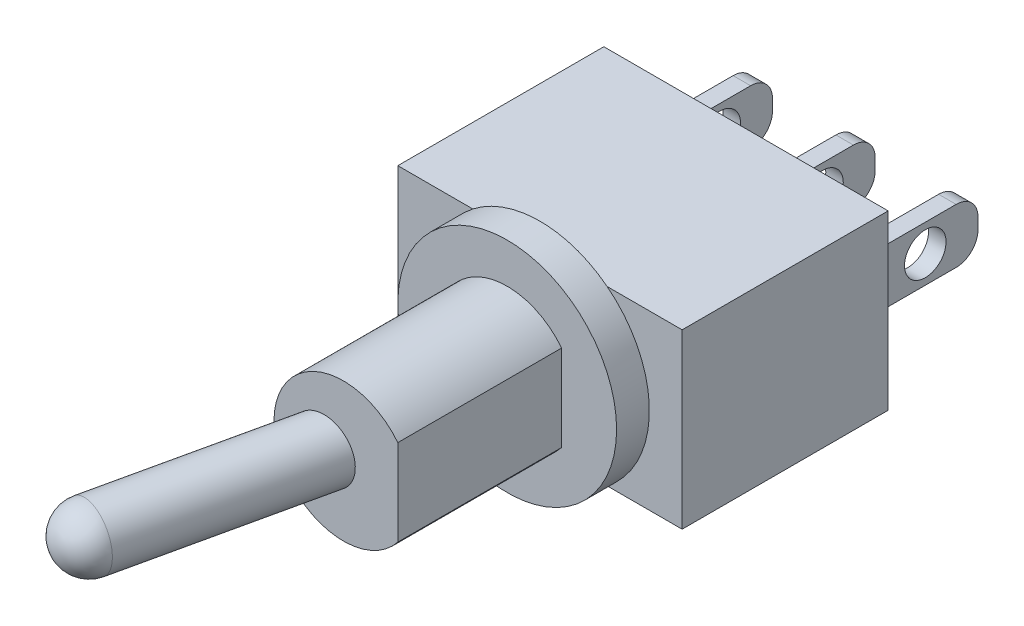
ISO-10303-21;
HEADER;
FILE_DESCRIPTION(('STEP AP214'),'2;1');
FILE_NAME('part.step','',(''),(''),'','','');
FILE_SCHEMA(('AUTOMOTIVE_DESIGN { 1 0 10303 214 1 1 1 1 }'));
ENDSEC;
DATA;
#1=APPLICATION_CONTEXT('core data for automotive mechanical design processes');
#2=APPLICATION_PROTOCOL_DEFINITION('international standard','automotive_design',2000,#1);
#3=PRODUCT_CONTEXT('',#1,'mechanical');
#4=PRODUCT('Part','Part','',(#3));
#5=PRODUCT_RELATED_PRODUCT_CATEGORY('part','',(#4));
#6=PRODUCT_DEFINITION_FORMATION('','',#4);
#7=PRODUCT_DEFINITION_CONTEXT('part definition',#1,'design');
#8=PRODUCT_DEFINITION('design','',#6,#7);
#9=PRODUCT_DEFINITION_SHAPE('','',#8);
#10=(LENGTH_UNIT() NAMED_UNIT(*) SI_UNIT(.MILLI.,.METRE.));
#11=(NAMED_UNIT(*) PLANE_ANGLE_UNIT() SI_UNIT($,.RADIAN.));
#12=(NAMED_UNIT(*) SI_UNIT($,.STERADIAN.) SOLID_ANGLE_UNIT());
#13=UNCERTAINTY_MEASURE_WITH_UNIT(LENGTH_MEASURE(1.E-05),#10,'distance_accuracy_value','');
#14=(GEOMETRIC_REPRESENTATION_CONTEXT(3) GLOBAL_UNCERTAINTY_ASSIGNED_CONTEXT((#13)) GLOBAL_UNIT_ASSIGNED_CONTEXT((#10,
#11,#12)) REPRESENTATION_CONTEXT('',''));
#15=CARTESIAN_POINT('',(0.,0.,0.));
#16=DIRECTION('',(0.,0.,1.));
#17=DIRECTION('',(1.,0.,0.));
#18=AXIS2_PLACEMENT_3D('',#15,#16,#17);
#19=CARTESIAN_POINT('',(0.,0.,0.));
#20=DIRECTION('',(0.,0.,1.));
#21=DIRECTION('',(1.,0.,0.));
#22=AXIS2_PLACEMENT_3D('',#19,#20,#21);
#23=PLANE('',#22);
#24=CARTESIAN_POINT('',(0.,0.,0.));
#25=DIRECTION('',(0.,0.,1.));
#26=DIRECTION('',(1.,0.,0.));
#27=AXIS2_PLACEMENT_3D('',#24,#25,#26);
#28=CIRCLE('',#27,5.0038);
#29=CARTESIAN_POINT('',(-3.07211398714306,3.9497,0.));
#30=VERTEX_POINT('',#29);
#31=CARTESIAN_POINT('',(-3.07211398714305,-3.9497,0.));
#32=VERTEX_POINT('',#31);
#33=EDGE_CURVE('E11',#30,#32,#28,.T.);
#34=ORIENTED_EDGE('',*,*,#33,.F.);
#35=DIRECTION('',(-1.,0.,0.));
#36=VECTOR('',#35,1.);
#37=CARTESIAN_POINT('',(6.5024,3.9497,0.));
#38=LINE('',#37,#36);
#39=CARTESIAN_POINT('',(-6.5024,3.9497,0.));
#40=VERTEX_POINT('',#39);
#41=EDGE_CURVE('E410',#30,#40,#38,.T.);
#42=ORIENTED_EDGE('',*,*,#41,.T.);
#43=DIRECTION('',(0.,1.,0.));
#44=VECTOR('',#43,1.);
#45=CARTESIAN_POINT('',(-6.5024,-3.9497,0.));
#46=LINE('',#45,#44);
#47=CARTESIAN_POINT('',(-6.5024,-3.9497,0.));
#48=VERTEX_POINT('',#47);
#49=EDGE_CURVE('E413',#48,#40,#46,.T.);
#50=ORIENTED_EDGE('',*,*,#49,.F.);
#51=DIRECTION('',(-1.,0.,0.));
#52=VECTOR('',#51,1.);
#53=CARTESIAN_POINT('',(6.5024,-3.9497,0.));
#54=LINE('',#53,#52);
#55=EDGE_CURVE('E65',#32,#48,#54,.T.);
#56=ORIENTED_EDGE('',*,*,#55,.F.);
#57=EDGE_LOOP('',(#34,#42,#50,#56));
#58=FACE_BOUND('',#57,.T.);
#59=ADVANCED_FACE('F40',(#58),#23,.T.);
#60=CARTESIAN_POINT('',(6.5024,-3.9497,-9.4234));
#61=DIRECTION('',(1.,0.,0.));
#62=DIRECTION('',(0.,0.,-1.));
#63=AXIS2_PLACEMENT_3D('',#60,#61,#62);
#64=PLANE('',#63);
#65=DIRECTION('',(0.,1.,0.));
#66=VECTOR('',#65,1.);
#67=CARTESIAN_POINT('',(6.5024,-3.9497,0.));
#68=LINE('',#67,#66);
#69=CARTESIAN_POINT('',(6.5024,-3.9497,0.));
#70=VERTEX_POINT('',#69);
#71=CARTESIAN_POINT('',(6.5024,3.9497,0.));
#72=VERTEX_POINT('',#71);
#73=EDGE_CURVE('E395',#70,#72,#68,.T.);
#74=ORIENTED_EDGE('',*,*,#73,.F.);
#75=DIRECTION('',(0.,0.,1.));
#76=VECTOR('',#75,1.);
#77=CARTESIAN_POINT('',(6.5024,-3.9497,-9.4234));
#78=LINE('',#77,#76);
#79=CARTESIAN_POINT('',(6.5024,-3.9497,-9.4234));
#80=VERTEX_POINT('',#79);
#81=EDGE_CURVE('E420',#80,#70,#78,.T.);
#82=ORIENTED_EDGE('',*,*,#81,.F.);
#83=DIRECTION('',(0.,1.,0.));
#84=VECTOR('',#83,1.);
#85=CARTESIAN_POINT('',(6.5024,-3.9497,-9.4234));
#86=LINE('',#85,#84);
#87=CARTESIAN_POINT('',(6.5024,3.9497,-9.4234));
#88=VERTEX_POINT('',#87);
#89=EDGE_CURVE('E396',#80,#88,#86,.T.);
#90=ORIENTED_EDGE('',*,*,#89,.T.);
#91=DIRECTION('',(0.,0.,1.));
#92=VECTOR('',#91,1.);
#93=CARTESIAN_POINT('',(6.5024,3.9497,-9.4234));
#94=LINE('',#93,#92);
#95=EDGE_CURVE('E407',#88,#72,#94,.T.);
#96=ORIENTED_EDGE('',*,*,#95,.T.);
#97=EDGE_LOOP('',(#74,#82,#90,#96));
#98=FACE_BOUND('',#97,.T.);
#99=ADVANCED_FACE('F42',(#98),#64,.T.);
#100=CARTESIAN_POINT('',(6.5024,-3.9497,-9.4234));
#101=DIRECTION('',(0.,1.,0.));
#102=DIRECTION('',(-1.,0.,0.));
#103=AXIS2_PLACEMENT_3D('',#100,#101,#102);
#104=PLANE('',#103);
#105=CARTESIAN_POINT('',(3.07211398714306,-3.9497,0.));
#106=VERTEX_POINT('',#105);
#107=EDGE_CURVE('E400',#70,#106,#54,.T.);
#108=ORIENTED_EDGE('',*,*,#107,.T.);
#109=EDGE_CURVE('E419',#106,#32,#54,.T.);
#110=ORIENTED_EDGE('',*,*,#109,.T.);
#111=ORIENTED_EDGE('',*,*,#55,.T.);
#112=DIRECTION('',(0.,0.,1.));
#113=VECTOR('',#112,1.);
#114=CARTESIAN_POINT('',(-6.5024,-3.9497,-9.4234));
#115=LINE('',#114,#113);
#116=CARTESIAN_POINT('',(-6.5024,-3.9497,-9.4234));
#117=VERTEX_POINT('',#116);
#118=EDGE_CURVE('E422',#117,#48,#115,.T.);
#119=ORIENTED_EDGE('',*,*,#118,.F.);
#120=DIRECTION('',(-1.,0.,0.));
#121=VECTOR('',#120,1.);
#122=CARTESIAN_POINT('',(6.5024,-3.9497,-9.4234));
#123=LINE('',#122,#121);
#124=EDGE_CURVE('E405',#80,#117,#123,.T.);
#125=ORIENTED_EDGE('',*,*,#124,.F.);
#126=ORIENTED_EDGE('',*,*,#81,.T.);
#127=EDGE_LOOP('',(#108,#110,#111,#119,#125,#126));
#128=FACE_BOUND('',#127,.T.);
#129=ADVANCED_FACE('F443',(#128),#104,.F.);
#130=CARTESIAN_POINT('',(-6.5024,-3.9497,-9.4234));
#131=DIRECTION('',(1.,0.,0.));
#132=DIRECTION('',(0.,0.,-1.));
#133=AXIS2_PLACEMENT_3D('',#130,#131,#132);
#134=PLANE('',#133);
#135=ORIENTED_EDGE('',*,*,#49,.T.);
#136=DIRECTION('',(0.,0.,1.));
#137=VECTOR('',#136,1.);
#138=CARTESIAN_POINT('',(-6.5024,3.9497,-9.4234));
#139=LINE('',#138,#137);
#140=CARTESIAN_POINT('',(-6.5024,3.9497,-9.4234));
#141=VERTEX_POINT('',#140);
#142=EDGE_CURVE('E425',#141,#40,#139,.T.);
#143=ORIENTED_EDGE('',*,*,#142,.F.);
#144=DIRECTION('',(0.,1.,0.));
#145=VECTOR('',#144,1.);
#146=CARTESIAN_POINT('',(-6.5024,-3.9497,-9.4234));
#147=LINE('',#146,#145);
#148=EDGE_CURVE('E403',#117,#141,#147,.T.);
#149=ORIENTED_EDGE('',*,*,#148,.F.);
#150=ORIENTED_EDGE('',*,*,#118,.T.);
#151=EDGE_LOOP('',(#135,#143,#149,#150));
#152=FACE_BOUND('',#151,.T.);
#153=ADVANCED_FACE('F490',(#152),#134,.F.);
#154=CARTESIAN_POINT('',(6.5024,3.9497,-9.4234));
#155=DIRECTION('',(0.,1.,0.));
#156=DIRECTION('',(-1.,0.,0.));
#157=AXIS2_PLACEMENT_3D('',#154,#155,#156);
#158=PLANE('',#157);
#159=CARTESIAN_POINT('',(3.07211398714306,3.9497,0.));
#160=VERTEX_POINT('',#159);
#161=EDGE_CURVE('E411',#72,#160,#38,.T.);
#162=ORIENTED_EDGE('',*,*,#161,.F.);
#163=ORIENTED_EDGE('',*,*,#95,.F.);
#164=DIRECTION('',(-1.,0.,0.));
#165=VECTOR('',#164,1.);
#166=CARTESIAN_POINT('',(6.5024,3.9497,-9.4234));
#167=LINE('',#166,#165);
#168=EDGE_CURVE('E399',#88,#141,#167,.T.);
#169=ORIENTED_EDGE('',*,*,#168,.T.);
#170=ORIENTED_EDGE('',*,*,#142,.T.);
#171=ORIENTED_EDGE('',*,*,#41,.F.);
#172=EDGE_CURVE('E414',#160,#30,#38,.T.);
#173=ORIENTED_EDGE('',*,*,#172,.F.);
#174=EDGE_LOOP('',(#162,#163,#169,#170,#171,#173));
#175=FACE_BOUND('',#174,.T.);
#176=ADVANCED_FACE('F434',(#175),#158,.T.);
#177=CARTESIAN_POINT('',(0.,0.,-9.4234));
#178=DIRECTION('',(0.,0.,1.));
#179=DIRECTION('',(1.,0.,0.));
#180=AXIS2_PLACEMENT_3D('',#177,#178,#179);
#181=PLANE('',#180);
#182=DIRECTION('',(-1.,0.,0.));
#183=VECTOR('',#182,1.);
#184=CARTESIAN_POINT('',(-4.3,-1.25,-9.4234));
#185=LINE('',#184,#183);
#186=CARTESIAN_POINT('',(-4.3,-1.25,-9.4234));
#187=VERTEX_POINT('',#186);
#188=CARTESIAN_POINT('',(-5.1,-1.25,-9.4234));
#189=VERTEX_POINT('',#188);
#190=EDGE_CURVE('E286',#187,#189,#185,.T.);
#191=ORIENTED_EDGE('',*,*,#190,.F.);
#192=DIRECTION('',(0.,1.,0.));
#193=VECTOR('',#192,1.);
#194=CARTESIAN_POINT('',(-4.3,0.,-9.4234));
#195=LINE('',#194,#193);
#196=CARTESIAN_POINT('',(-4.3,1.25,-9.4234));
#197=VERTEX_POINT('',#196);
#198=EDGE_CURVE('E250',#187,#197,#195,.T.);
#199=ORIENTED_EDGE('',*,*,#198,.T.);
#200=DIRECTION('',(-1.,0.,0.));
#201=VECTOR('',#200,1.);
#202=CARTESIAN_POINT('',(-4.3,1.25,-9.4234));
#203=LINE('',#202,#201);
#204=CARTESIAN_POINT('',(-5.1,1.25,-9.4234));
#205=VERTEX_POINT('',#204);
#206=EDGE_CURVE('E289',#197,#205,#203,.T.);
#207=ORIENTED_EDGE('',*,*,#206,.T.);
#208=DIRECTION('',(0.,1.,0.));
#209=VECTOR('',#208,1.);
#210=CARTESIAN_POINT('',(-5.1,0.,-9.4234));
#211=LINE('',#210,#209);
#212=EDGE_CURVE('E267',#189,#205,#211,.T.);
#213=ORIENTED_EDGE('',*,*,#212,.F.);
#214=EDGE_LOOP('',(#191,#199,#207,#213));
#215=FACE_BOUND('',#214,.T.);
#216=DIRECTION('',(-1.,0.,0.));
#217=VECTOR('',#216,1.);
#218=CARTESIAN_POINT('',(0.4,-1.25,-9.4234));
#219=LINE('',#218,#217);
#220=CARTESIAN_POINT('',(0.4,-1.25,-9.4234));
#221=VERTEX_POINT('',#220);
#222=CARTESIAN_POINT('',(-0.4,-1.25,-9.4234));
#223=VERTEX_POINT('',#222);
#224=EDGE_CURVE('E337',#221,#223,#219,.T.);
#225=ORIENTED_EDGE('',*,*,#224,.F.);
#226=DIRECTION('',(0.,1.,0.));
#227=VECTOR('',#226,1.);
#228=CARTESIAN_POINT('',(0.4,0.,-9.4234));
#229=LINE('',#228,#227);
#230=CARTESIAN_POINT('',(0.4,1.25,-9.4234));
#231=VERTEX_POINT('',#230);
#232=EDGE_CURVE('E301',#221,#231,#229,.T.);
#233=ORIENTED_EDGE('',*,*,#232,.T.);
#234=DIRECTION('',(-1.,0.,0.));
#235=VECTOR('',#234,1.);
#236=CARTESIAN_POINT('',(0.4,1.25,-9.4234));
#237=LINE('',#236,#235);
#238=CARTESIAN_POINT('',(-0.4,1.25,-9.4234));
#239=VERTEX_POINT('',#238);
#240=EDGE_CURVE('E340',#231,#239,#237,.T.);
#241=ORIENTED_EDGE('',*,*,#240,.T.);
#242=DIRECTION('',(0.,1.,0.));
#243=VECTOR('',#242,1.);
#244=CARTESIAN_POINT('',(-0.4,0.,-9.4234));
#245=LINE('',#244,#243);
#246=EDGE_CURVE('E318',#223,#239,#245,.T.);
#247=ORIENTED_EDGE('',*,*,#246,.F.);
#248=EDGE_LOOP('',(#225,#233,#241,#247));
#249=FACE_BOUND('',#248,.T.);
#250=DIRECTION('',(-1.,0.,0.));
#251=VECTOR('',#250,1.);
#252=CARTESIAN_POINT('',(5.1,-1.25,-9.4234));
#253=LINE('',#252,#251);
#254=CARTESIAN_POINT('',(5.1,-1.25,-9.4234));
#255=VERTEX_POINT('',#254);
#256=CARTESIAN_POINT('',(4.3,-1.25,-9.4234));
#257=VERTEX_POINT('',#256);
#258=EDGE_CURVE('E388',#255,#257,#253,.T.);
#259=ORIENTED_EDGE('',*,*,#258,.F.);
#260=DIRECTION('',(0.,1.,0.));
#261=VECTOR('',#260,1.);
#262=CARTESIAN_POINT('',(5.1,0.,-9.4234));
#263=LINE('',#262,#261);
#264=CARTESIAN_POINT('',(5.1,1.25,-9.4234));
#265=VERTEX_POINT('',#264);
#266=EDGE_CURVE('E352',#255,#265,#263,.T.);
#267=ORIENTED_EDGE('',*,*,#266,.T.);
#268=DIRECTION('',(-1.,0.,0.));
#269=VECTOR('',#268,1.);
#270=CARTESIAN_POINT('',(5.1,1.25,-9.4234));
#271=LINE('',#270,#269);
#272=CARTESIAN_POINT('',(4.3,1.25,-9.4234));
#273=VERTEX_POINT('',#272);
#274=EDGE_CURVE('E391',#265,#273,#271,.T.);
#275=ORIENTED_EDGE('',*,*,#274,.T.);
#276=DIRECTION('',(0.,1.,0.));
#277=VECTOR('',#276,1.);
#278=CARTESIAN_POINT('',(4.3,0.,-9.4234));
#279=LINE('',#278,#277);
#280=EDGE_CURVE('E369',#257,#273,#279,.T.);
#281=ORIENTED_EDGE('',*,*,#280,.F.);
#282=EDGE_LOOP('',(#259,#267,#275,#281));
#283=FACE_BOUND('',#282,.T.);
#284=ORIENTED_EDGE('',*,*,#89,.F.);
#285=ORIENTED_EDGE('',*,*,#124,.T.);
#286=ORIENTED_EDGE('',*,*,#148,.T.);
#287=ORIENTED_EDGE('',*,*,#168,.F.);
#288=EDGE_LOOP('',(#284,#285,#286,#287));
#289=FACE_BOUND('',#288,.T.);
#290=ADVANCED_FACE('F478',(#215,#249,#283,#289),#181,.F.);
#291=EDGE_CURVE('E49',#106,#160,#28,.T.);
#292=ORIENTED_EDGE('',*,*,#291,.F.);
#293=ORIENTED_EDGE('',*,*,#107,.F.);
#294=ORIENTED_EDGE('',*,*,#73,.T.);
#295=ORIENTED_EDGE('',*,*,#161,.T.);
#296=EDGE_LOOP('',(#292,#293,#294,#295));
#297=FACE_BOUND('',#296,.T.);
#298=ADVANCED_FACE('F440',(#297),#23,.T.);
#299=CARTESIAN_POINT('',(5.1,0.250000000000001,-13.9352));
#300=DIRECTION('',(-1.,0.,0.));
#301=DIRECTION('',(0.,0.,1.));
#302=AXIS2_PLACEMENT_3D('',#299,#300,#301);
#303=CYLINDRICAL_SURFACE('',#302,1.);
#304=CARTESIAN_POINT('',(4.3,0.250000000000001,-13.9352));
#305=DIRECTION('',(1.,0.,0.));
#306=DIRECTION('',(0.,0.,-1.));
#307=AXIS2_PLACEMENT_3D('',#304,#305,#306);
#308=CIRCLE('',#307,1.);
#309=CARTESIAN_POINT('',(4.3,1.25,-13.9352));
#310=VERTEX_POINT('',#309);
#311=CARTESIAN_POINT('',(4.3,0.250000000000001,-14.9352));
#312=VERTEX_POINT('',#311);
#313=EDGE_CURVE('E344',#310,#312,#308,.F.);
#314=ORIENTED_EDGE('',*,*,#313,.F.);
#315=DIRECTION('',(-1.,0.,0.));
#316=VECTOR('',#315,1.);
#317=CARTESIAN_POINT('',(5.1,1.25,-13.9352));
#318=LINE('',#317,#316);
#319=CARTESIAN_POINT('',(5.1,1.25,-13.9352));
#320=VERTEX_POINT('',#319);
#321=EDGE_CURVE('E393',#320,#310,#318,.T.);
#322=ORIENTED_EDGE('',*,*,#321,.F.);
#323=CARTESIAN_POINT('',(5.1,0.250000000000001,-13.9352));
#324=DIRECTION('',(1.,0.,0.));
#325=DIRECTION('',(0.,0.,-1.));
#326=AXIS2_PLACEMENT_3D('',#323,#324,#325);
#327=CIRCLE('',#326,1.);
#328=CARTESIAN_POINT('',(5.1,0.250000000000001,-14.9352));
#329=VERTEX_POINT('',#328);
#330=EDGE_CURVE('E345',#320,#329,#327,.F.);
#331=ORIENTED_EDGE('',*,*,#330,.T.);
#332=DIRECTION('',(-1.,0.,0.));
#333=VECTOR('',#332,1.);
#334=CARTESIAN_POINT('',(5.1,0.250000000000001,-14.9352));
#335=LINE('',#334,#333);
#336=EDGE_CURVE('E363',#329,#312,#335,.T.);
#337=ORIENTED_EDGE('',*,*,#336,.T.);
#338=EDGE_LOOP('',(#314,#322,#331,#337));
#339=FACE_BOUND('',#338,.T.);
#340=ADVANCED_FACE('F477',(#339),#303,.T.);
#341=CARTESIAN_POINT('',(5.1,1.25,0.));
#342=DIRECTION('',(0.,1.,0.));
#343=DIRECTION('',(0.,0.,1.));
#344=AXIS2_PLACEMENT_3D('',#341,#342,#343);
#345=PLANE('',#344);
#346=DIRECTION('',(0.,0.,-1.));
#347=VECTOR('',#346,1.);
#348=CARTESIAN_POINT('',(4.3,1.25,0.));
#349=LINE('',#348,#347);
#350=EDGE_CURVE('E366',#273,#310,#349,.T.);
#351=ORIENTED_EDGE('',*,*,#350,.F.);
#352=ORIENTED_EDGE('',*,*,#274,.F.);
#353=DIRECTION('',(0.,0.,-1.));
#354=VECTOR('',#353,1.);
#355=CARTESIAN_POINT('',(5.1,1.25,0.));
#356=LINE('',#355,#354);
#357=EDGE_CURVE('E348',#265,#320,#356,.T.);
#358=ORIENTED_EDGE('',*,*,#357,.T.);
#359=ORIENTED_EDGE('',*,*,#321,.T.);
#360=EDGE_LOOP('',(#351,#352,#358,#359));
#361=FACE_BOUND('',#360,.T.);
#362=ADVANCED_FACE('F483',(#361),#345,.T.);
#363=CARTESIAN_POINT('',(5.1,-1.25,0.));
#364=DIRECTION('',(0.,1.,0.));
#365=DIRECTION('',(0.,0.,1.));
#366=AXIS2_PLACEMENT_3D('',#363,#364,#365);
#367=PLANE('',#366);
#368=DIRECTION('',(0.,0.,-1.));
#369=VECTOR('',#368,1.);
#370=CARTESIAN_POINT('',(4.3,-1.25,0.));
#371=LINE('',#370,#369);
#372=CARTESIAN_POINT('',(4.3,-1.25,-13.9352));
#373=VERTEX_POINT('',#372);
#374=EDGE_CURVE('E372',#257,#373,#371,.T.);
#375=ORIENTED_EDGE('',*,*,#374,.T.);
#376=DIRECTION('',(-1.,0.,0.));
#377=VECTOR('',#376,1.);
#378=CARTESIAN_POINT('',(5.1,-1.25,-13.9352));
#379=LINE('',#378,#377);
#380=CARTESIAN_POINT('',(5.1,-1.25,-13.9352));
#381=VERTEX_POINT('',#380);
#382=EDGE_CURVE('E385',#381,#373,#379,.T.);
#383=ORIENTED_EDGE('',*,*,#382,.F.);
#384=DIRECTION('',(0.,0.,-1.));
#385=VECTOR('',#384,1.);
#386=CARTESIAN_POINT('',(5.1,-1.25,0.));
#387=LINE('',#386,#385);
#388=EDGE_CURVE('E354',#255,#381,#387,.T.);
#389=ORIENTED_EDGE('',*,*,#388,.F.);
#390=ORIENTED_EDGE('',*,*,#258,.T.);
#391=EDGE_LOOP('',(#375,#383,#389,#390));
#392=FACE_BOUND('',#391,.T.);
#393=ADVANCED_FACE('F495',(#392),#367,.F.);
#394=CARTESIAN_POINT('',(5.1,-0.250000000000001,-13.9352));
#395=DIRECTION('',(-1.,0.,0.));
#396=DIRECTION('',(0.,0.,1.));
#397=AXIS2_PLACEMENT_3D('',#394,#395,#396);
#398=CYLINDRICAL_SURFACE('',#397,1.);
#399=CARTESIAN_POINT('',(4.3,-0.250000000000001,-13.9352));
#400=DIRECTION('',(1.,0.,0.));
#401=DIRECTION('',(0.,0.,-1.));
#402=AXIS2_PLACEMENT_3D('',#399,#400,#401);
#403=CIRCLE('',#402,1.);
#404=CARTESIAN_POINT('',(4.3,-0.250000000000001,-14.9352));
#405=VERTEX_POINT('',#404);
#406=EDGE_CURVE('E374',#373,#405,#403,.T.);
#407=ORIENTED_EDGE('',*,*,#406,.T.);
#408=DIRECTION('',(-1.,0.,0.));
#409=VECTOR('',#408,1.);
#410=CARTESIAN_POINT('',(5.1,-0.250000000000001,-14.9352));
#411=LINE('',#410,#409);
#412=CARTESIAN_POINT('',(5.1,-0.250000000000001,-14.9352));
#413=VERTEX_POINT('',#412);
#414=EDGE_CURVE('E382',#413,#405,#411,.T.);
#415=ORIENTED_EDGE('',*,*,#414,.F.);
#416=CARTESIAN_POINT('',(5.1,-0.250000000000001,-13.9352));
#417=DIRECTION('',(1.,0.,0.));
#418=DIRECTION('',(0.,0.,-1.));
#419=AXIS2_PLACEMENT_3D('',#416,#417,#418);
#420=CIRCLE('',#419,1.);
#421=EDGE_CURVE('E356',#381,#413,#420,.T.);
#422=ORIENTED_EDGE('',*,*,#421,.F.);
#423=ORIENTED_EDGE('',*,*,#382,.T.);
#424=EDGE_LOOP('',(#407,#415,#422,#423));
#425=FACE_BOUND('',#424,.T.);
#426=ADVANCED_FACE('F499',(#425),#398,.T.);
#427=CARTESIAN_POINT('',(5.1,0.,-14.9352));
#428=DIRECTION('',(0.,0.,1.));
#429=DIRECTION('',(1.,0.,0.));
#430=AXIS2_PLACEMENT_3D('',#427,#428,#429);
#431=PLANE('',#430);
#432=DIRECTION('',(0.,1.,0.));
#433=VECTOR('',#432,1.);
#434=CARTESIAN_POINT('',(4.3,0.,-14.9352));
#435=LINE('',#434,#433);
#436=EDGE_CURVE('E376',#405,#312,#435,.T.);
#437=ORIENTED_EDGE('',*,*,#436,.T.);
#438=ORIENTED_EDGE('',*,*,#336,.F.);
#439=DIRECTION('',(0.,1.,0.));
#440=VECTOR('',#439,1.);
#441=CARTESIAN_POINT('',(5.1,0.,-14.9352));
#442=LINE('',#441,#440);
#443=EDGE_CURVE('E358',#413,#329,#442,.T.);
#444=ORIENTED_EDGE('',*,*,#443,.F.);
#445=ORIENTED_EDGE('',*,*,#414,.T.);
#446=EDGE_LOOP('',(#437,#438,#444,#445));
#447=FACE_BOUND('',#446,.T.);
#448=ADVANCED_FACE('F503',(#447),#431,.F.);
#449=CARTESIAN_POINT('',(5.1,0.,-12.5234));
#450=DIRECTION('',(-1.,0.,0.));
#451=DIRECTION('',(0.,0.,1.));
#452=AXIS2_PLACEMENT_3D('',#449,#450,#451);
#453=CYLINDRICAL_SURFACE('',#452,0.949999999999999);
#454=CARTESIAN_POINT('',(5.1,0.,-12.5234));
#455=DIRECTION('',(1.,0.,0.));
#456=DIRECTION('',(0.,0.,-1.));
#457=AXIS2_PLACEMENT_3D('',#454,#455,#456);
#458=CIRCLE('',#457,0.949999999999999);
#459=CARTESIAN_POINT('',(5.1,0.,-13.4734));
#460=VERTEX_POINT('',#459);
#461=EDGE_CURVE('E360',#460,#460,#458,.T.);
#462=ORIENTED_EDGE('',*,*,#461,.T.);
#463=EDGE_LOOP('',(#462));
#464=FACE_BOUND('',#463,.T.);
#465=CARTESIAN_POINT('',(4.3,0.,-12.5234));
#466=DIRECTION('',(1.,0.,0.));
#467=DIRECTION('',(0.,0.,-1.));
#468=AXIS2_PLACEMENT_3D('',#465,#466,#467);
#469=CIRCLE('',#468,0.949999999999999);
#470=CARTESIAN_POINT('',(4.3,0.,-13.4734));
#471=VERTEX_POINT('',#470);
#472=EDGE_CURVE('E349',#471,#471,#469,.T.);
#473=ORIENTED_EDGE('',*,*,#472,.F.);
#474=EDGE_LOOP('',(#473));
#475=FACE_BOUND('',#474,.T.);
#476=ADVANCED_FACE('F507',(#464,#475),#453,.F.);
#477=CARTESIAN_POINT('',(5.1,0.,0.));
#478=DIRECTION('',(1.,0.,0.));
#479=DIRECTION('',(0.,0.,-1.));
#480=AXIS2_PLACEMENT_3D('',#477,#478,#479);
#481=PLANE('',#480);
#482=ORIENTED_EDGE('',*,*,#330,.F.);
#483=ORIENTED_EDGE('',*,*,#357,.F.);
#484=ORIENTED_EDGE('',*,*,#266,.F.);
#485=ORIENTED_EDGE('',*,*,#388,.T.);
#486=ORIENTED_EDGE('',*,*,#421,.T.);
#487=ORIENTED_EDGE('',*,*,#443,.T.);
#488=EDGE_LOOP('',(#482,#483,#484,#485,#486,#487));
#489=FACE_BOUND('',#488,.T.);
#490=ORIENTED_EDGE('',*,*,#461,.F.);
#491=EDGE_LOOP('',(#490));
#492=FACE_BOUND('',#491,.T.);
#493=ADVANCED_FACE('F511',(#489,#492),#481,.T.);
#494=CARTESIAN_POINT('',(4.3,0.,0.));
#495=DIRECTION('',(1.,0.,0.));
#496=DIRECTION('',(0.,0.,-1.));
#497=AXIS2_PLACEMENT_3D('',#494,#495,#496);
#498=PLANE('',#497);
#499=ORIENTED_EDGE('',*,*,#313,.T.);
#500=ORIENTED_EDGE('',*,*,#436,.F.);
#501=ORIENTED_EDGE('',*,*,#406,.F.);
#502=ORIENTED_EDGE('',*,*,#374,.F.);
#503=ORIENTED_EDGE('',*,*,#280,.T.);
#504=ORIENTED_EDGE('',*,*,#350,.T.);
#505=EDGE_LOOP('',(#499,#500,#501,#502,#503,#504));
#506=FACE_BOUND('',#505,.T.);
#507=ORIENTED_EDGE('',*,*,#472,.T.);
#508=EDGE_LOOP('',(#507));
#509=FACE_BOUND('',#508,.T.);
#510=ADVANCED_FACE('F513',(#506,#509),#498,.F.);
#511=CARTESIAN_POINT('',(0.4,0.25,-13.9352));
#512=DIRECTION('',(-1.,0.,0.));
#513=DIRECTION('',(0.,0.,1.));
#514=AXIS2_PLACEMENT_3D('',#511,#512,#513);
#515=CYLINDRICAL_SURFACE('',#514,1.);
#516=CARTESIAN_POINT('',(-0.4,0.25,-13.9352));
#517=DIRECTION('',(1.,0.,0.));
#518=DIRECTION('',(0.,0.,-1.));
#519=AXIS2_PLACEMENT_3D('',#516,#517,#518);
#520=CIRCLE('',#519,1.);
#521=CARTESIAN_POINT('',(-0.4,1.25,-13.9352));
#522=VERTEX_POINT('',#521);
#523=CARTESIAN_POINT('',(-0.4,0.25,-14.9352));
#524=VERTEX_POINT('',#523);
#525=EDGE_CURVE('E293',#522,#524,#520,.F.);
#526=ORIENTED_EDGE('',*,*,#525,.F.);
#527=DIRECTION('',(-1.,0.,0.));
#528=VECTOR('',#527,1.);
#529=CARTESIAN_POINT('',(0.4,1.25,-13.9352));
#530=LINE('',#529,#528);
#531=CARTESIAN_POINT('',(0.4,1.25,-13.9352));
#532=VERTEX_POINT('',#531);
#533=EDGE_CURVE('E342',#532,#522,#530,.T.);
#534=ORIENTED_EDGE('',*,*,#533,.F.);
#535=CARTESIAN_POINT('',(0.4,0.25,-13.9352));
#536=DIRECTION('',(1.,0.,0.));
#537=DIRECTION('',(0.,0.,-1.));
#538=AXIS2_PLACEMENT_3D('',#535,#536,#537);
#539=CIRCLE('',#538,1.);
#540=CARTESIAN_POINT('',(0.4,0.25,-14.9352));
#541=VERTEX_POINT('',#540);
#542=EDGE_CURVE('E294',#532,#541,#539,.F.);
#543=ORIENTED_EDGE('',*,*,#542,.T.);
#544=DIRECTION('',(-1.,0.,0.));
#545=VECTOR('',#544,1.);
#546=CARTESIAN_POINT('',(0.4,0.25,-14.9352));
#547=LINE('',#546,#545);
#548=EDGE_CURVE('E312',#541,#524,#547,.T.);
#549=ORIENTED_EDGE('',*,*,#548,.T.);
#550=EDGE_LOOP('',(#526,#534,#543,#549));
#551=FACE_BOUND('',#550,.T.);
#552=ADVANCED_FACE('F516',(#551),#515,.T.);
#553=CARTESIAN_POINT('',(0.4,1.25,0.));
#554=DIRECTION('',(0.,1.,0.));
#555=DIRECTION('',(0.,0.,1.));
#556=AXIS2_PLACEMENT_3D('',#553,#554,#555);
#557=PLANE('',#556);
#558=DIRECTION('',(0.,0.,-1.));
#559=VECTOR('',#558,1.);
#560=CARTESIAN_POINT('',(-0.4,1.25,0.));
#561=LINE('',#560,#559);
#562=EDGE_CURVE('E315',#239,#522,#561,.T.);
#563=ORIENTED_EDGE('',*,*,#562,.F.);
#564=ORIENTED_EDGE('',*,*,#240,.F.);
#565=DIRECTION('',(0.,0.,-1.));
#566=VECTOR('',#565,1.);
#567=CARTESIAN_POINT('',(0.4,1.25,0.));
#568=LINE('',#567,#566);
#569=EDGE_CURVE('E297',#231,#532,#568,.T.);
#570=ORIENTED_EDGE('',*,*,#569,.T.);
#571=ORIENTED_EDGE('',*,*,#533,.T.);
#572=EDGE_LOOP('',(#563,#564,#570,#571));
#573=FACE_BOUND('',#572,.T.);
#574=ADVANCED_FACE('F523',(#573),#557,.T.);
#575=CARTESIAN_POINT('',(0.4,-1.25,0.));
#576=DIRECTION('',(0.,1.,0.));
#577=DIRECTION('',(0.,0.,1.));
#578=AXIS2_PLACEMENT_3D('',#575,#576,#577);
#579=PLANE('',#578);
#580=DIRECTION('',(0.,0.,-1.));
#581=VECTOR('',#580,1.);
#582=CARTESIAN_POINT('',(-0.4,-1.25,0.));
#583=LINE('',#582,#581);
#584=CARTESIAN_POINT('',(-0.4,-1.25,-13.9352));
#585=VERTEX_POINT('',#584);
#586=EDGE_CURVE('E321',#223,#585,#583,.T.);
#587=ORIENTED_EDGE('',*,*,#586,.T.);
#588=DIRECTION('',(-1.,0.,0.));
#589=VECTOR('',#588,1.);
#590=CARTESIAN_POINT('',(0.4,-1.25,-13.9352));
#591=LINE('',#590,#589);
#592=CARTESIAN_POINT('',(0.4,-1.25,-13.9352));
#593=VERTEX_POINT('',#592);
#594=EDGE_CURVE('E334',#593,#585,#591,.T.);
#595=ORIENTED_EDGE('',*,*,#594,.F.);
#596=DIRECTION('',(0.,0.,-1.));
#597=VECTOR('',#596,1.);
#598=CARTESIAN_POINT('',(0.4,-1.25,0.));
#599=LINE('',#598,#597);
#600=EDGE_CURVE('E303',#221,#593,#599,.T.);
#601=ORIENTED_EDGE('',*,*,#600,.F.);
#602=ORIENTED_EDGE('',*,*,#224,.T.);
#603=EDGE_LOOP('',(#587,#595,#601,#602));
#604=FACE_BOUND('',#603,.T.);
#605=ADVANCED_FACE('F527',(#604),#579,.F.);
#606=CARTESIAN_POINT('',(0.4,-0.250000000000001,-13.9352));
#607=DIRECTION('',(-1.,0.,0.));
#608=DIRECTION('',(0.,0.,1.));
#609=AXIS2_PLACEMENT_3D('',#606,#607,#608);
#610=CYLINDRICAL_SURFACE('',#609,1.);
#611=CARTESIAN_POINT('',(-0.4,-0.250000000000001,-13.9352));
#612=DIRECTION('',(1.,0.,0.));
#613=DIRECTION('',(0.,0.,-1.));
#614=AXIS2_PLACEMENT_3D('',#611,#612,#613);
#615=CIRCLE('',#614,1.);
#616=CARTESIAN_POINT('',(-0.4,-0.250000000000001,-14.9352));
#617=VERTEX_POINT('',#616);
#618=EDGE_CURVE('E323',#585,#617,#615,.T.);
#619=ORIENTED_EDGE('',*,*,#618,.T.);
#620=DIRECTION('',(-1.,0.,0.));
#621=VECTOR('',#620,1.);
#622=CARTESIAN_POINT('',(0.4,-0.250000000000001,-14.9352));
#623=LINE('',#622,#621);
#624=CARTESIAN_POINT('',(0.4,-0.250000000000001,-14.9352));
#625=VERTEX_POINT('',#624);
#626=EDGE_CURVE('E331',#625,#617,#623,.T.);
#627=ORIENTED_EDGE('',*,*,#626,.F.);
#628=CARTESIAN_POINT('',(0.4,-0.250000000000001,-13.9352));
#629=DIRECTION('',(1.,0.,0.));
#630=DIRECTION('',(0.,0.,-1.));
#631=AXIS2_PLACEMENT_3D('',#628,#629,#630);
#632=CIRCLE('',#631,1.);
#633=EDGE_CURVE('E305',#593,#625,#632,.T.);
#634=ORIENTED_EDGE('',*,*,#633,.F.);
#635=ORIENTED_EDGE('',*,*,#594,.T.);
#636=EDGE_LOOP('',(#619,#627,#634,#635));
#637=FACE_BOUND('',#636,.T.);
#638=ADVANCED_FACE('F531',(#637),#610,.T.);
#639=CARTESIAN_POINT('',(0.4,0.,-14.9352));
#640=DIRECTION('',(0.,0.,1.));
#641=DIRECTION('',(1.,0.,0.));
#642=AXIS2_PLACEMENT_3D('',#639,#640,#641);
#643=PLANE('',#642);
#644=DIRECTION('',(0.,1.,0.));
#645=VECTOR('',#644,1.);
#646=CARTESIAN_POINT('',(-0.4,0.,-14.9352));
#647=LINE('',#646,#645);
#648=EDGE_CURVE('E325',#617,#524,#647,.T.);
#649=ORIENTED_EDGE('',*,*,#648,.T.);
#650=ORIENTED_EDGE('',*,*,#548,.F.);
#651=DIRECTION('',(0.,1.,0.));
#652=VECTOR('',#651,1.);
#653=CARTESIAN_POINT('',(0.4,0.,-14.9352));
#654=LINE('',#653,#652);
#655=EDGE_CURVE('E307',#625,#541,#654,.T.);
#656=ORIENTED_EDGE('',*,*,#655,.F.);
#657=ORIENTED_EDGE('',*,*,#626,.T.);
#658=EDGE_LOOP('',(#649,#650,#656,#657));
#659=FACE_BOUND('',#658,.T.);
#660=ADVANCED_FACE('F535',(#659),#643,.F.);
#661=CARTESIAN_POINT('',(0.4,0.,-12.5234));
#662=DIRECTION('',(-1.,0.,0.));
#663=DIRECTION('',(0.,0.,1.));
#664=AXIS2_PLACEMENT_3D('',#661,#662,#663);
#665=CYLINDRICAL_SURFACE('',#664,0.949999999999999);
#666=CARTESIAN_POINT('',(0.4,0.,-12.5234));
#667=DIRECTION('',(1.,0.,0.));
#668=DIRECTION('',(0.,0.,-1.));
#669=AXIS2_PLACEMENT_3D('',#666,#667,#668);
#670=CIRCLE('',#669,0.949999999999999);
#671=CARTESIAN_POINT('',(0.4,0.,-13.4734));
#672=VERTEX_POINT('',#671);
#673=EDGE_CURVE('E309',#672,#672,#670,.T.);
#674=ORIENTED_EDGE('',*,*,#673,.T.);
#675=EDGE_LOOP('',(#674));
#676=FACE_BOUND('',#675,.T.);
#677=CARTESIAN_POINT('',(-0.4,0.,-12.5234));
#678=DIRECTION('',(1.,0.,0.));
#679=DIRECTION('',(0.,0.,-1.));
#680=AXIS2_PLACEMENT_3D('',#677,#678,#679);
#681=CIRCLE('',#680,0.949999999999999);
#682=CARTESIAN_POINT('',(-0.4,0.,-13.4734));
#683=VERTEX_POINT('',#682);
#684=EDGE_CURVE('E298',#683,#683,#681,.T.);
#685=ORIENTED_EDGE('',*,*,#684,.F.);
#686=EDGE_LOOP('',(#685));
#687=FACE_BOUND('',#686,.T.);
#688=ADVANCED_FACE('F539',(#676,#687),#665,.F.);
#689=CARTESIAN_POINT('',(0.4,0.,0.));
#690=DIRECTION('',(1.,0.,0.));
#691=DIRECTION('',(0.,0.,-1.));
#692=AXIS2_PLACEMENT_3D('',#689,#690,#691);
#693=PLANE('',#692);
#694=ORIENTED_EDGE('',*,*,#542,.F.);
#695=ORIENTED_EDGE('',*,*,#569,.F.);
#696=ORIENTED_EDGE('',*,*,#232,.F.);
#697=ORIENTED_EDGE('',*,*,#600,.T.);
#698=ORIENTED_EDGE('',*,*,#633,.T.);
#699=ORIENTED_EDGE('',*,*,#655,.T.);
#700=EDGE_LOOP('',(#694,#695,#696,#697,#698,#699));
#701=FACE_BOUND('',#700,.T.);
#702=ORIENTED_EDGE('',*,*,#673,.F.);
#703=EDGE_LOOP('',(#702));
#704=FACE_BOUND('',#703,.T.);
#705=ADVANCED_FACE('F543',(#701,#704),#693,.T.);
#706=CARTESIAN_POINT('',(-0.4,0.,0.));
#707=DIRECTION('',(1.,0.,0.));
#708=DIRECTION('',(0.,0.,-1.));
#709=AXIS2_PLACEMENT_3D('',#706,#707,#708);
#710=PLANE('',#709);
#711=ORIENTED_EDGE('',*,*,#525,.T.);
#712=ORIENTED_EDGE('',*,*,#648,.F.);
#713=ORIENTED_EDGE('',*,*,#618,.F.);
#714=ORIENTED_EDGE('',*,*,#586,.F.);
#715=ORIENTED_EDGE('',*,*,#246,.T.);
#716=ORIENTED_EDGE('',*,*,#562,.T.);
#717=EDGE_LOOP('',(#711,#712,#713,#714,#715,#716));
#718=FACE_BOUND('',#717,.T.);
#719=ORIENTED_EDGE('',*,*,#684,.T.);
#720=EDGE_LOOP('',(#719));
#721=FACE_BOUND('',#720,.T.);
#722=ADVANCED_FACE('F545',(#718,#721),#710,.F.);
#723=CARTESIAN_POINT('',(-4.3,0.25,-13.9352));
#724=DIRECTION('',(-1.,0.,0.));
#725=DIRECTION('',(0.,0.,1.));
#726=AXIS2_PLACEMENT_3D('',#723,#724,#725);
#727=CYLINDRICAL_SURFACE('',#726,1.);
#728=CARTESIAN_POINT('',(-5.1,0.25,-13.9352));
#729=DIRECTION('',(1.,0.,0.));
#730=DIRECTION('',(0.,0.,-1.));
#731=AXIS2_PLACEMENT_3D('',#728,#729,#730);
#732=CIRCLE('',#731,1.);
#733=CARTESIAN_POINT('',(-5.1,1.25,-13.9352));
#734=VERTEX_POINT('',#733);
#735=CARTESIAN_POINT('',(-5.1,0.25,-14.9352));
#736=VERTEX_POINT('',#735);
#737=EDGE_CURVE('E240',#734,#736,#732,.F.);
#738=ORIENTED_EDGE('',*,*,#737,.F.);
#739=DIRECTION('',(-1.,0.,0.));
#740=VECTOR('',#739,1.);
#741=CARTESIAN_POINT('',(-4.3,1.25,-13.9352));
#742=LINE('',#741,#740);
#743=CARTESIAN_POINT('',(-4.3,1.25,-13.9352));
#744=VERTEX_POINT('',#743);
#745=EDGE_CURVE('E291',#744,#734,#742,.T.);
#746=ORIENTED_EDGE('',*,*,#745,.F.);
#747=CARTESIAN_POINT('',(-4.3,0.25,-13.9352));
#748=DIRECTION('',(1.,0.,0.));
#749=DIRECTION('',(0.,0.,-1.));
#750=AXIS2_PLACEMENT_3D('',#747,#748,#749);
#751=CIRCLE('',#750,1.);
#752=CARTESIAN_POINT('',(-4.3,0.25,-14.9352));
#753=VERTEX_POINT('',#752);
#754=EDGE_CURVE('E243',#744,#753,#751,.F.);
#755=ORIENTED_EDGE('',*,*,#754,.T.);
#756=DIRECTION('',(-1.,0.,0.));
#757=VECTOR('',#756,1.);
#758=CARTESIAN_POINT('',(-4.3,0.25,-14.9352));
#759=LINE('',#758,#757);
#760=EDGE_CURVE('E261',#753,#736,#759,.T.);
#761=ORIENTED_EDGE('',*,*,#760,.T.);
#762=EDGE_LOOP('',(#738,#746,#755,#761));
#763=FACE_BOUND('',#762,.T.);
#764=ADVANCED_FACE('F548',(#763),#727,.T.);
#765=CARTESIAN_POINT('',(-4.3,1.25,0.));
#766=DIRECTION('',(0.,1.,0.));
#767=DIRECTION('',(0.,0.,1.));
#768=AXIS2_PLACEMENT_3D('',#765,#766,#767);
#769=PLANE('',#768);
#770=DIRECTION('',(0.,0.,-1.));
#771=VECTOR('',#770,1.);
#772=CARTESIAN_POINT('',(-5.1,1.25,0.));
#773=LINE('',#772,#771);
#774=EDGE_CURVE('E264',#205,#734,#773,.T.);
#775=ORIENTED_EDGE('',*,*,#774,.F.);
#776=ORIENTED_EDGE('',*,*,#206,.F.);
#777=DIRECTION('',(0.,0.,-1.));
#778=VECTOR('',#777,1.);
#779=CARTESIAN_POINT('',(-4.3,1.25,0.));
#780=LINE('',#779,#778);
#781=EDGE_CURVE('E246',#197,#744,#780,.T.);
#782=ORIENTED_EDGE('',*,*,#781,.T.);
#783=ORIENTED_EDGE('',*,*,#745,.T.);
#784=EDGE_LOOP('',(#775,#776,#782,#783));
#785=FACE_BOUND('',#784,.T.);
#786=ADVANCED_FACE('F555',(#785),#769,.T.);
#787=CARTESIAN_POINT('',(-4.3,-1.25,0.));
#788=DIRECTION('',(0.,1.,0.));
#789=DIRECTION('',(0.,0.,1.));
#790=AXIS2_PLACEMENT_3D('',#787,#788,#789);
#791=PLANE('',#790);
#792=DIRECTION('',(0.,0.,-1.));
#793=VECTOR('',#792,1.);
#794=CARTESIAN_POINT('',(-5.1,-1.25,0.));
#795=LINE('',#794,#793);
#796=CARTESIAN_POINT('',(-5.1,-1.25,-13.9352));
#797=VERTEX_POINT('',#796);
#798=EDGE_CURVE('E270',#189,#797,#795,.T.);
#799=ORIENTED_EDGE('',*,*,#798,.T.);
#800=DIRECTION('',(-1.,0.,0.));
#801=VECTOR('',#800,1.);
#802=CARTESIAN_POINT('',(-4.3,-1.25,-13.9352));
#803=LINE('',#802,#801);
#804=CARTESIAN_POINT('',(-4.3,-1.25,-13.9352));
#805=VERTEX_POINT('',#804);
#806=EDGE_CURVE('E283',#805,#797,#803,.T.);
#807=ORIENTED_EDGE('',*,*,#806,.F.);
#808=DIRECTION('',(0.,0.,-1.));
#809=VECTOR('',#808,1.);
#810=CARTESIAN_POINT('',(-4.3,-1.25,0.));
#811=LINE('',#810,#809);
#812=EDGE_CURVE('E252',#187,#805,#811,.T.);
#813=ORIENTED_EDGE('',*,*,#812,.F.);
#814=ORIENTED_EDGE('',*,*,#190,.T.);
#815=EDGE_LOOP('',(#799,#807,#813,#814));
#816=FACE_BOUND('',#815,.T.);
#817=ADVANCED_FACE('F559',(#816),#791,.F.);
#818=CARTESIAN_POINT('',(-4.3,-0.250000000000002,-13.9352));
#819=DIRECTION('',(-1.,0.,0.));
#820=DIRECTION('',(0.,0.,1.));
#821=AXIS2_PLACEMENT_3D('',#818,#819,#820);
#822=CYLINDRICAL_SURFACE('',#821,1.);
#823=CARTESIAN_POINT('',(-5.1,-0.250000000000002,-13.9352));
#824=DIRECTION('',(1.,0.,0.));
#825=DIRECTION('',(0.,0.,-1.));
#826=AXIS2_PLACEMENT_3D('',#823,#824,#825);
#827=CIRCLE('',#826,1.);
#828=CARTESIAN_POINT('',(-5.1,-0.250000000000002,-14.9352));
#829=VERTEX_POINT('',#828);
#830=EDGE_CURVE('E272',#797,#829,#827,.T.);
#831=ORIENTED_EDGE('',*,*,#830,.T.);
#832=DIRECTION('',(-1.,0.,0.));
#833=VECTOR('',#832,1.);
#834=CARTESIAN_POINT('',(-4.3,-0.250000000000002,-14.9352));
#835=LINE('',#834,#833);
#836=CARTESIAN_POINT('',(-4.3,-0.250000000000002,-14.9352));
#837=VERTEX_POINT('',#836);
#838=EDGE_CURVE('E280',#837,#829,#835,.T.);
#839=ORIENTED_EDGE('',*,*,#838,.F.);
#840=CARTESIAN_POINT('',(-4.3,-0.250000000000002,-13.9352));
#841=DIRECTION('',(1.,0.,0.));
#842=DIRECTION('',(0.,0.,-1.));
#843=AXIS2_PLACEMENT_3D('',#840,#841,#842);
#844=CIRCLE('',#843,1.);
#845=EDGE_CURVE('E254',#805,#837,#844,.T.);
#846=ORIENTED_EDGE('',*,*,#845,.F.);
#847=ORIENTED_EDGE('',*,*,#806,.T.);
#848=EDGE_LOOP('',(#831,#839,#846,#847));
#849=FACE_BOUND('',#848,.T.);
#850=ADVANCED_FACE('F563',(#849),#822,.T.);
#851=CARTESIAN_POINT('',(-4.3,0.,-14.9352));
#852=DIRECTION('',(0.,0.,1.));
#853=DIRECTION('',(1.,0.,0.));
#854=AXIS2_PLACEMENT_3D('',#851,#852,#853);
#855=PLANE('',#854);
#856=DIRECTION('',(0.,1.,0.));
#857=VECTOR('',#856,1.);
#858=CARTESIAN_POINT('',(-5.1,0.,-14.9352));
#859=LINE('',#858,#857);
#860=EDGE_CURVE('E274',#829,#736,#859,.T.);
#861=ORIENTED_EDGE('',*,*,#860,.T.);
#862=ORIENTED_EDGE('',*,*,#760,.F.);
#863=DIRECTION('',(0.,1.,0.));
#864=VECTOR('',#863,1.);
#865=CARTESIAN_POINT('',(-4.3,0.,-14.9352));
#866=LINE('',#865,#864);
#867=EDGE_CURVE('E256',#837,#753,#866,.T.);
#868=ORIENTED_EDGE('',*,*,#867,.F.);
#869=ORIENTED_EDGE('',*,*,#838,.T.);
#870=EDGE_LOOP('',(#861,#862,#868,#869));
#871=FACE_BOUND('',#870,.T.);
#872=ADVANCED_FACE('F567',(#871),#855,.F.);
#873=CARTESIAN_POINT('',(-4.3,0.,-12.5234));
#874=DIRECTION('',(-1.,0.,0.));
#875=DIRECTION('',(0.,0.,1.));
#876=AXIS2_PLACEMENT_3D('',#873,#874,#875);
#877=CYLINDRICAL_SURFACE('',#876,0.949999999999999);
#878=CARTESIAN_POINT('',(-4.3,0.,-12.5234));
#879=DIRECTION('',(1.,0.,0.));
#880=DIRECTION('',(0.,0.,-1.));
#881=AXIS2_PLACEMENT_3D('',#878,#879,#880);
#882=CIRCLE('',#881,0.949999999999999);
#883=CARTESIAN_POINT('',(-4.3,0.,-13.4734));
#884=VERTEX_POINT('',#883);
#885=EDGE_CURVE('E258',#884,#884,#882,.T.);
#886=ORIENTED_EDGE('',*,*,#885,.T.);
#887=EDGE_LOOP('',(#886));
#888=FACE_BOUND('',#887,.T.);
#889=CARTESIAN_POINT('',(-5.1,0.,-12.5234));
#890=DIRECTION('',(1.,0.,0.));
#891=DIRECTION('',(0.,0.,-1.));
#892=AXIS2_PLACEMENT_3D('',#889,#890,#891);
#893=CIRCLE('',#892,0.949999999999999);
#894=CARTESIAN_POINT('',(-5.1,0.,-13.4734));
#895=VERTEX_POINT('',#894);
#896=EDGE_CURVE('E247',#895,#895,#893,.T.);
#897=ORIENTED_EDGE('',*,*,#896,.F.);
#898=EDGE_LOOP('',(#897));
#899=FACE_BOUND('',#898,.T.);
#900=ADVANCED_FACE('F571',(#888,#899),#877,.F.);
#901=CARTESIAN_POINT('',(-4.3,0.,0.));
#902=DIRECTION('',(1.,0.,0.));
#903=DIRECTION('',(0.,0.,-1.));
#904=AXIS2_PLACEMENT_3D('',#901,#902,#903);
#905=PLANE('',#904);
#906=ORIENTED_EDGE('',*,*,#754,.F.);
#907=ORIENTED_EDGE('',*,*,#781,.F.);
#908=ORIENTED_EDGE('',*,*,#198,.F.);
#909=ORIENTED_EDGE('',*,*,#812,.T.);
#910=ORIENTED_EDGE('',*,*,#845,.T.);
#911=ORIENTED_EDGE('',*,*,#867,.T.);
#912=EDGE_LOOP('',(#906,#907,#908,#909,#910,#911));
#913=FACE_BOUND('',#912,.T.);
#914=ORIENTED_EDGE('',*,*,#885,.F.);
#915=EDGE_LOOP('',(#914));
#916=FACE_BOUND('',#915,.T.);
#917=ADVANCED_FACE('F464',(#913,#916),#905,.T.);
#918=CARTESIAN_POINT('',(-5.1,0.,0.));
#919=DIRECTION('',(1.,0.,0.));
#920=DIRECTION('',(0.,0.,-1.));
#921=AXIS2_PLACEMENT_3D('',#918,#919,#920);
#922=PLANE('',#921);
#923=ORIENTED_EDGE('',*,*,#737,.T.);
#924=ORIENTED_EDGE('',*,*,#860,.F.);
#925=ORIENTED_EDGE('',*,*,#830,.F.);
#926=ORIENTED_EDGE('',*,*,#798,.F.);
#927=ORIENTED_EDGE('',*,*,#212,.T.);
#928=ORIENTED_EDGE('',*,*,#774,.T.);
#929=EDGE_LOOP('',(#923,#924,#925,#926,#927,#928));
#930=FACE_BOUND('',#929,.T.);
#931=ORIENTED_EDGE('',*,*,#896,.T.);
#932=EDGE_LOOP('',(#931));
#933=FACE_BOUND('',#932,.T.);
#934=ADVANCED_FACE('F455',(#930,#933),#922,.F.);
#935=CARTESIAN_POINT('',(0.,0.,0.));
#936=DIRECTION('',(0.,0.,1.));
#937=DIRECTION('',(1.,0.,0.));
#938=AXIS2_PLACEMENT_3D('',#935,#936,#937);
#939=PLANE('',#938);
#940=EDGE_CURVE('E234',#160,#30,#28,.T.);
#941=ORIENTED_EDGE('',*,*,#940,.F.);
#942=ORIENTED_EDGE('',*,*,#172,.T.);
#943=EDGE_LOOP('',(#941,#942));
#944=FACE_BOUND('',#943,.T.);
#945=ADVANCED_FACE('F453',(#944),#939,.F.);
#946=CARTESIAN_POINT('',(0.,0.,1.4986));
#947=DIRECTION('',(0.,0.,-1.));
#948=DIRECTION('',(-1.,0.,0.));
#949=AXIS2_PLACEMENT_3D('',#946,#947,#948);
#950=CYLINDRICAL_SURFACE('',#949,5.0038);
#951=CARTESIAN_POINT('',(0.,0.,1.4986));
#952=DIRECTION('',(0.,0.,1.));
#953=DIRECTION('',(1.,0.,0.));
#954=AXIS2_PLACEMENT_3D('',#951,#952,#953);
#955=CIRCLE('',#954,5.0038);
#956=CARTESIAN_POINT('',(5.0038,0.,1.4986));
#957=VERTEX_POINT('',#956);
#958=EDGE_CURVE('E238',#957,#957,#955,.T.);
#959=ORIENTED_EDGE('',*,*,#958,.F.);
#960=EDGE_LOOP('',(#959));
#961=FACE_BOUND('',#960,.T.);
#962=ORIENTED_EDGE('',*,*,#940,.T.);
#963=ORIENTED_EDGE('',*,*,#33,.T.);
#964=EDGE_CURVE('E51',#32,#106,#28,.T.);
#965=ORIENTED_EDGE('',*,*,#964,.T.);
#966=ORIENTED_EDGE('',*,*,#291,.T.);
#967=EDGE_LOOP('',(#962,#963,#965,#966));
#968=FACE_BOUND('',#967,.T.);
#969=ADVANCED_FACE('F449',(#961,#968),#950,.T.);
#970=CARTESIAN_POINT('',(0.,0.,1.4986));
#971=DIRECTION('',(0.,0.,1.));
#972=DIRECTION('',(1.,0.,0.));
#973=AXIS2_PLACEMENT_3D('',#970,#971,#972);
#974=PLANE('',#973);
#975=CARTESIAN_POINT('',(0.,0.,1.4986));
#976=DIRECTION('',(0.,0.,1.));
#977=DIRECTION('',(1.,0.,0.));
#978=AXIS2_PLACEMENT_3D('',#975,#976,#977);
#979=CIRCLE('',#978,3.175);
#980=CARTESIAN_POINT('',(2.4892,1.97091561463194,1.4986));
#981=VERTEX_POINT('',#980);
#982=CARTESIAN_POINT('',(2.4892,-1.97091561463194,1.4986));
#983=VERTEX_POINT('',#982);
#984=EDGE_CURVE('E231',#981,#983,#979,.T.);
#985=ORIENTED_EDGE('',*,*,#984,.F.);
#986=DIRECTION('',(0.,1.,0.));
#987=VECTOR('',#986,1.);
#988=CARTESIAN_POINT('',(2.4892,-1.97091561463194,1.4986));
#989=LINE('',#988,#987);
#990=EDGE_CURVE('E57',#983,#981,#989,.T.);
#991=ORIENTED_EDGE('',*,*,#990,.F.);
#992=EDGE_LOOP('',(#985,#991));
#993=FACE_BOUND('',#992,.T.);
#994=ORIENTED_EDGE('',*,*,#958,.T.);
#995=EDGE_LOOP('',(#994));
#996=FACE_BOUND('',#995,.T.);
#997=ADVANCED_FACE('F461',(#993,#996),#974,.T.);
#998=ORIENTED_EDGE('',*,*,#109,.F.);
#999=ORIENTED_EDGE('',*,*,#964,.F.);
#1000=EDGE_LOOP('',(#998,#999));
#1001=FACE_BOUND('',#1000,.T.);
#1002=ADVANCED_FACE('F447',(#1001),#939,.F.);
#1003=CARTESIAN_POINT('',(0.,0.,8.9916));
#1004=DIRECTION('',(0.,0.,-1.));
#1005=DIRECTION('',(-1.,0.,0.));
#1006=AXIS2_PLACEMENT_3D('',#1003,#1004,#1005);
#1007=CYLINDRICAL_SURFACE('',#1006,3.175);
#1008=ORIENTED_EDGE('',*,*,#984,.T.);
#1009=DIRECTION('',(0.,0.,-1.));
#1010=VECTOR('',#1009,1.);
#1011=CARTESIAN_POINT('',(2.4892,-1.97091561463194,8.9916));
#1012=LINE('',#1011,#1010);
#1013=CARTESIAN_POINT('',(2.4892,-1.97091561463194,8.9916));
#1014=VERTEX_POINT('',#1013);
#1015=EDGE_CURVE('E219',#1014,#983,#1012,.T.);
#1016=ORIENTED_EDGE('',*,*,#1015,.F.);
#1017=CARTESIAN_POINT('',(0.,0.,8.9916));
#1018=DIRECTION('',(0.,0.,1.));
#1019=DIRECTION('',(1.,0.,0.));
#1020=AXIS2_PLACEMENT_3D('',#1017,#1018,#1019);
#1021=CIRCLE('',#1020,3.175);
#1022=CARTESIAN_POINT('',(2.4892,1.97091561463194,8.9916));
#1023=VERTEX_POINT('',#1022);
#1024=EDGE_CURVE('E225',#1023,#1014,#1021,.T.);
#1025=ORIENTED_EDGE('',*,*,#1024,.F.);
#1026=DIRECTION('',(0.,0.,-1.));
#1027=VECTOR('',#1026,1.);
#1028=CARTESIAN_POINT('',(2.4892,1.97091561463194,8.9916));
#1029=LINE('',#1028,#1027);
#1030=EDGE_CURVE('E222',#1023,#981,#1029,.T.);
#1031=ORIENTED_EDGE('',*,*,#1030,.T.);
#1032=EDGE_LOOP('',(#1008,#1016,#1025,#1031));
#1033=FACE_BOUND('',#1032,.T.);
#1034=ADVANCED_FACE('F230',(#1033),#1007,.T.);
#1035=CARTESIAN_POINT('',(2.4892,-1.97091561463194,8.9916));
#1036=DIRECTION('',(-1.,0.,0.));
#1037=DIRECTION('',(0.,0.,1.));
#1038=AXIS2_PLACEMENT_3D('',#1035,#1036,#1037);
#1039=PLANE('',#1038);
#1040=ORIENTED_EDGE('',*,*,#990,.T.);
#1041=ORIENTED_EDGE('',*,*,#1030,.F.);
#1042=DIRECTION('',(0.,1.,0.));
#1043=VECTOR('',#1042,1.);
#1044=CARTESIAN_POINT('',(2.4892,-1.97091561463194,8.9916));
#1045=LINE('',#1044,#1043);
#1046=EDGE_CURVE('E215',#1014,#1023,#1045,.T.);
#1047=ORIENTED_EDGE('',*,*,#1046,.F.);
#1048=ORIENTED_EDGE('',*,*,#1015,.T.);
#1049=EDGE_LOOP('',(#1040,#1041,#1047,#1048));
#1050=FACE_BOUND('',#1049,.T.);
#1051=ADVANCED_FACE('F217',(#1050),#1039,.F.);
#1052=CARTESIAN_POINT('',(0.,0.,8.9916));
#1053=DIRECTION('',(0.,0.,1.));
#1054=DIRECTION('',(1.,0.,0.));
#1055=AXIS2_PLACEMENT_3D('',#1052,#1053,#1054);
#1056=PLANE('',#1055);
#1057=CARTESIAN_POINT('',(-0.886778650578378,0.,8.9916));
#1058=DIRECTION('',(0.,0.,1.));
#1059=DIRECTION('',(-1.,0.,0.));
#1060=AXIS2_PLACEMENT_3D('',#1057,#1058,#1059);
#1061=ELLIPSE('',#1060,1.43091848149737,1.397);
#1062=CARTESIAN_POINT('',(-2.31769713207575,0.,8.9916));
#1063=VERTEX_POINT('',#1062);
#1064=EDGE_CURVE('E44',#1063,#1063,#1061,.F.);
#1065=ORIENTED_EDGE('',*,*,#1064,.T.);
#1066=EDGE_LOOP('',(#1065));
#1067=FACE_BOUND('',#1066,.T.);
#1068=ORIENTED_EDGE('',*,*,#1024,.T.);
#1069=ORIENTED_EDGE('',*,*,#1046,.T.);
#1070=EDGE_LOOP('',(#1068,#1069));
#1071=FACE_BOUND('',#1070,.T.);
#1072=ADVANCED_FACE('F227',(#1067,#1071),#1056,.T.);
#1073=CARTESIAN_POINT('',(-2.83600826143759,0.,17.7840065812925));
#1074=DIRECTION('',(-0.216439613938103,0.,0.976296007119933));
#1075=DIRECTION('',(-0.976296007119933,0.,-0.216439613938103));
#1076=AXIS2_PLACEMENT_3D('',#1073,#1074,#1075);
#1077=SPHERICAL_SURFACE('',#1076,1.39699999999998);
#1078=CARTESIAN_POINT('',(-2.83600826143759,0.,17.7840065812925));
#1079=DIRECTION('',(-0.216439613938103,0.,0.976296007119933));
#1080=DIRECTION('',(0.976296007119933,0.,0.216439613938103));
#1081=AXIS2_PLACEMENT_3D('',#1078,#1079,#1080);
#1082=CIRCLE('',#1081,1.397);
#1083=CARTESIAN_POINT('',(-1.47212273949104,0.,18.0863727219641));
#1084=VERTEX_POINT('',#1083);
#1085=EDGE_CURVE('E709',#1084,#1084,#1082,.T.);
#1086=ORIENTED_EDGE('',*,*,#1085,.T.);
#1087=EDGE_LOOP('',(#1086));
#1088=FACE_BOUND('',#1087,.T.);
#1089=ADVANCED_FACE('F680',(#1088),#1077,.T.);
#1090=CARTESIAN_POINT('',(-3.13837440210911,0.,19.147892103239));
#1091=DIRECTION('',(-0.216439613938103,0.,0.976296007119933));
#1092=DIRECTION('',(0.976296007119933,0.,0.216439613938103));
#1093=AXIS2_PLACEMENT_3D('',#1090,#1091,#1092);
#1094=CYLINDRICAL_SURFACE('',#1093,1.397);
#1095=ORIENTED_EDGE('',*,*,#1064,.F.);
#1096=EDGE_LOOP('',(#1095));
#1097=FACE_BOUND('',#1096,.T.);
#1098=ORIENTED_EDGE('',*,*,#1085,.F.);
#1099=EDGE_LOOP('',(#1098));
#1100=FACE_BOUND('',#1099,.T.);
#1101=ADVANCED_FACE('F690',(#1097,#1100),#1094,.T.);
#1102=CLOSED_SHELL('',(#59,#99,#129,#153,#176,#290,#298,#340,#362,#393,#426,#448,#476,#493,#510,
#552,#574,#605,#638,#660,#688,#705,#722,#764,#786,#817,#850,#872,#900,#917,#934,#945,#969,#997,
#1002,#1034,#1051,#1072,#1089,#1101));
#1103=MANIFOLD_SOLID_BREP('B2',#1102);
#1104=ADVANCED_BREP_SHAPE_REPRESENTATION('',(#18,#1103),#14);
#1105=SHAPE_DEFINITION_REPRESENTATION(#9,#1104);
ENDSEC;
END-ISO-10303-21;
